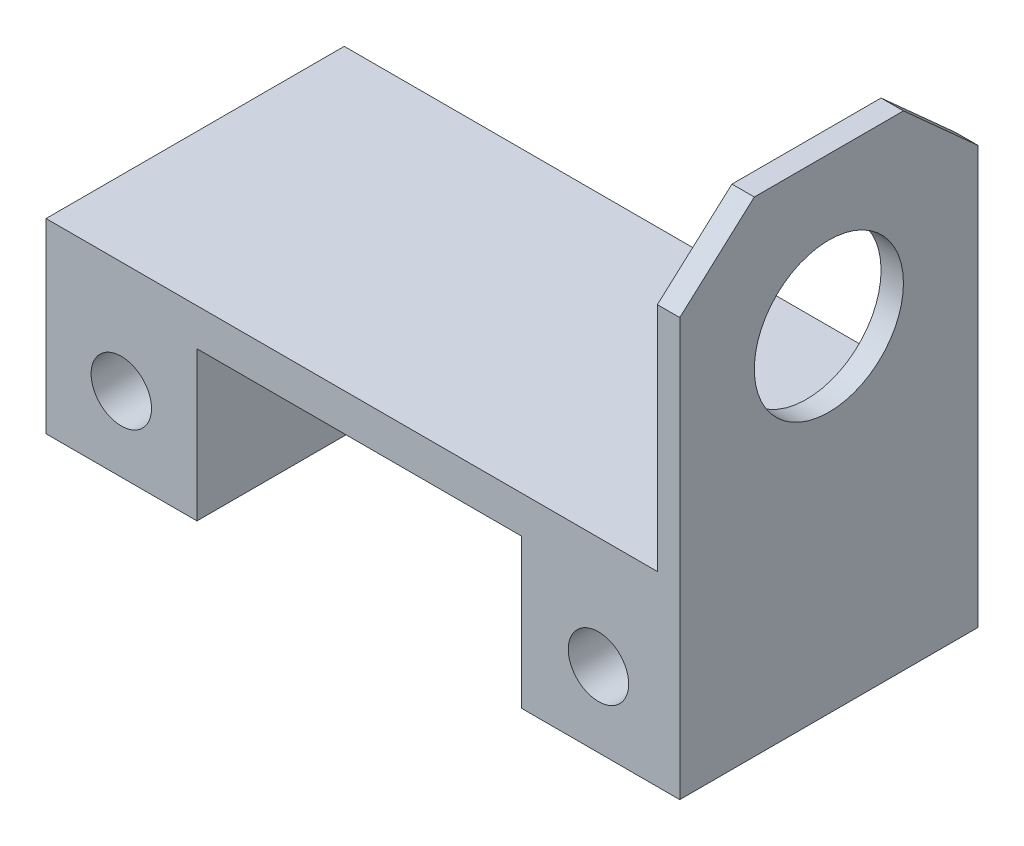
ISO-10303-21;
HEADER;
FILE_DESCRIPTION(('STEP AP214'),'2;1');
FILE_NAME('part.step','',(''),(''),'','','');
FILE_SCHEMA(('AUTOMOTIVE_DESIGN { 1 0 10303 214 1 1 1 1 }'));
ENDSEC;
DATA;
#1=APPLICATION_CONTEXT('core data for automotive mechanical design processes');
#2=APPLICATION_PROTOCOL_DEFINITION('international standard','automotive_design',2000,#1);
#3=PRODUCT_CONTEXT('',#1,'mechanical');
#4=PRODUCT('Part','Part','',(#3));
#5=PRODUCT_RELATED_PRODUCT_CATEGORY('part','',(#4));
#6=PRODUCT_DEFINITION_FORMATION('','',#4);
#7=PRODUCT_DEFINITION_CONTEXT('part definition',#1,'design');
#8=PRODUCT_DEFINITION('design','',#6,#7);
#9=PRODUCT_DEFINITION_SHAPE('','',#8);
#10=(LENGTH_UNIT() NAMED_UNIT(*) SI_UNIT(.MILLI.,.METRE.));
#11=(NAMED_UNIT(*) PLANE_ANGLE_UNIT() SI_UNIT($,.RADIAN.));
#12=(NAMED_UNIT(*) SI_UNIT($,.STERADIAN.) SOLID_ANGLE_UNIT());
#13=UNCERTAINTY_MEASURE_WITH_UNIT(LENGTH_MEASURE(1.E-05),#10,'distance_accuracy_value','');
#14=(GEOMETRIC_REPRESENTATION_CONTEXT(3) GLOBAL_UNCERTAINTY_ASSIGNED_CONTEXT((#13)) GLOBAL_UNIT_ASSIGNED_CONTEXT((#10,
#11,#12)) REPRESENTATION_CONTEXT('',''));
#15=CARTESIAN_POINT('',(0.,0.,0.));
#16=DIRECTION('',(0.,0.,1.));
#17=DIRECTION('',(1.,0.,0.));
#18=AXIS2_PLACEMENT_3D('',#15,#16,#17);
#19=CARTESIAN_POINT('',(0.,12.5,-40.));
#20=DIRECTION('',(0.,-1.,0.));
#21=DIRECTION('',(0.,0.,-1.));
#22=AXIS2_PLACEMENT_3D('',#19,#20,#21);
#23=PLANE('',#22);
#24=DIRECTION('',(0.,0.,1.));
#25=VECTOR('',#24,1.);
#26=CARTESIAN_POINT('',(40.,12.5,-40.));
#27=LINE('',#26,#25);
#28=CARTESIAN_POINT('',(40.,12.5,-40.));
#29=VERTEX_POINT('',#28);
#30=CARTESIAN_POINT('',(40.,12.5,0.));
#31=VERTEX_POINT('',#30);
#32=EDGE_CURVE('E160',#29,#31,#27,.T.);
#33=ORIENTED_EDGE('',*,*,#32,.F.);
#34=DIRECTION('',(1.,0.,0.));
#35=VECTOR('',#34,1.);
#36=CARTESIAN_POINT('',(0.,12.5,-40.));
#37=LINE('',#36,#35);
#38=CARTESIAN_POINT('',(-42.,12.5,-40.));
#39=VERTEX_POINT('',#38);
#40=EDGE_CURVE('E139',#39,#29,#37,.T.);
#41=ORIENTED_EDGE('',*,*,#40,.F.);
#42=DIRECTION('',(0.,0.,1.));
#43=VECTOR('',#42,1.);
#44=CARTESIAN_POINT('',(-42.,12.5,-40.));
#45=LINE('',#44,#43);
#46=CARTESIAN_POINT('',(-42.,12.5,0.));
#47=VERTEX_POINT('',#46);
#48=EDGE_CURVE('E292',#39,#47,#45,.T.);
#49=ORIENTED_EDGE('',*,*,#48,.T.);
#50=DIRECTION('',(1.,0.,0.));
#51=VECTOR('',#50,1.);
#52=CARTESIAN_POINT('',(0.,12.5,0.));
#53=LINE('',#52,#51);
#54=EDGE_CURVE('E290',#47,#31,#53,.T.);
#55=ORIENTED_EDGE('',*,*,#54,.T.);
#56=EDGE_LOOP('',(#33,#41,#49,#55));
#57=FACE_BOUND('',#56,.T.);
#58=ADVANCED_FACE('F47',(#57),#23,.F.);
#59=CARTESIAN_POINT('',(21.75,0.,-40.));
#60=DIRECTION('',(1.,0.,0.));
#61=DIRECTION('',(0.,1.,0.));
#62=AXIS2_PLACEMENT_3D('',#59,#60,#61);
#63=PLANE('',#62);
#64=DIRECTION('',(0.,1.,0.));
#65=VECTOR('',#64,1.);
#66=CARTESIAN_POINT('',(21.75,0.,0.));
#67=LINE('',#66,#65);
#68=CARTESIAN_POINT('',(21.75,-12.5,0.));
#69=VERTEX_POINT('',#68);
#70=CARTESIAN_POINT('',(21.75,7.5,0.));
#71=VERTEX_POINT('',#70);
#72=EDGE_CURVE('E301',#69,#71,#67,.T.);
#73=ORIENTED_EDGE('',*,*,#72,.T.);
#74=DIRECTION('',(0.,0.,1.));
#75=VECTOR('',#74,1.);
#76=CARTESIAN_POINT('',(21.75,7.5,-40.));
#77=LINE('',#76,#75);
#78=CARTESIAN_POINT('',(21.75,7.5,-40.));
#79=VERTEX_POINT('',#78);
#80=EDGE_CURVE('E11',#79,#71,#77,.T.);
#81=ORIENTED_EDGE('',*,*,#80,.F.);
#82=DIRECTION('',(0.,1.,0.));
#83=VECTOR('',#82,1.);
#84=CARTESIAN_POINT('',(21.75,0.,-40.));
#85=LINE('',#84,#83);
#86=CARTESIAN_POINT('',(21.75,-12.5,-40.));
#87=VERTEX_POINT('',#86);
#88=EDGE_CURVE('E67',#87,#79,#85,.T.);
#89=ORIENTED_EDGE('',*,*,#88,.F.);
#90=DIRECTION('',(0.,0.,1.));
#91=VECTOR('',#90,1.);
#92=CARTESIAN_POINT('',(21.75,-12.5,-40.));
#93=LINE('',#92,#91);
#94=EDGE_CURVE('E51',#87,#69,#93,.T.);
#95=ORIENTED_EDGE('',*,*,#94,.T.);
#96=EDGE_LOOP('',(#73,#81,#89,#95));
#97=FACE_BOUND('',#96,.T.);
#98=ADVANCED_FACE('F327',(#97),#63,.F.);
#99=CARTESIAN_POINT('',(0.,7.5,-40.));
#100=DIRECTION('',(0.,-1.,0.));
#101=DIRECTION('',(0.,0.,-1.));
#102=AXIS2_PLACEMENT_3D('',#99,#100,#101);
#103=PLANE('',#102);
#104=DIRECTION('',(1.,0.,0.));
#105=VECTOR('',#104,1.);
#106=CARTESIAN_POINT('',(0.,7.5,0.));
#107=LINE('',#106,#105);
#108=CARTESIAN_POINT('',(-21.75,7.5,0.));
#109=VERTEX_POINT('',#108);
#110=EDGE_CURVE('E159',#109,#71,#107,.T.);
#111=ORIENTED_EDGE('',*,*,#110,.F.);
#112=DIRECTION('',(0.,0.,1.));
#113=VECTOR('',#112,1.);
#114=CARTESIAN_POINT('',(-21.75,7.5,-40.));
#115=LINE('',#114,#113);
#116=CARTESIAN_POINT('',(-21.75,7.5,-40.));
#117=VERTEX_POINT('',#116);
#118=EDGE_CURVE('E58',#117,#109,#115,.T.);
#119=ORIENTED_EDGE('',*,*,#118,.F.);
#120=DIRECTION('',(1.,0.,0.));
#121=VECTOR('',#120,1.);
#122=CARTESIAN_POINT('',(0.,7.5,-40.));
#123=LINE('',#122,#121);
#124=EDGE_CURVE('E130',#117,#79,#123,.T.);
#125=ORIENTED_EDGE('',*,*,#124,.T.);
#126=ORIENTED_EDGE('',*,*,#80,.T.);
#127=EDGE_LOOP('',(#111,#119,#125,#126));
#128=FACE_BOUND('',#127,.T.);
#129=ADVANCED_FACE('F328',(#128),#103,.T.);
#130=CARTESIAN_POINT('',(-21.75,0.,-40.));
#131=DIRECTION('',(1.,0.,0.));
#132=DIRECTION('',(0.,0.,-1.));
#133=AXIS2_PLACEMENT_3D('',#130,#131,#132);
#134=PLANE('',#133);
#135=DIRECTION('',(0.,1.,0.));
#136=VECTOR('',#135,1.);
#137=CARTESIAN_POINT('',(-21.75,0.,0.));
#138=LINE('',#137,#136);
#139=CARTESIAN_POINT('',(-21.75,-12.5,0.));
#140=VERTEX_POINT('',#139);
#141=EDGE_CURVE('E115',#140,#109,#138,.T.);
#142=ORIENTED_EDGE('',*,*,#141,.F.);
#143=DIRECTION('',(0.,0.,1.));
#144=VECTOR('',#143,1.);
#145=CARTESIAN_POINT('',(-21.75,-12.5,-40.));
#146=LINE('',#145,#144);
#147=CARTESIAN_POINT('',(-21.75,-12.5,-40.));
#148=VERTEX_POINT('',#147);
#149=EDGE_CURVE('E111',#148,#140,#146,.T.);
#150=ORIENTED_EDGE('',*,*,#149,.F.);
#151=DIRECTION('',(0.,1.,0.));
#152=VECTOR('',#151,1.);
#153=CARTESIAN_POINT('',(-21.75,0.,-40.));
#154=LINE('',#153,#152);
#155=EDGE_CURVE('E114',#148,#117,#154,.T.);
#156=ORIENTED_EDGE('',*,*,#155,.T.);
#157=ORIENTED_EDGE('',*,*,#118,.T.);
#158=EDGE_LOOP('',(#142,#150,#156,#157));
#159=FACE_BOUND('',#158,.T.);
#160=ADVANCED_FACE('F113',(#159),#134,.T.);
#161=CARTESIAN_POINT('',(0.,-12.5,-40.));
#162=DIRECTION('',(0.,-1.,0.));
#163=DIRECTION('',(0.,0.,-1.));
#164=AXIS2_PLACEMENT_3D('',#161,#162,#163);
#165=PLANE('',#164);
#166=DIRECTION('',(1.,0.,0.));
#167=VECTOR('',#166,1.);
#168=CARTESIAN_POINT('',(0.,-12.5,0.));
#169=LINE('',#168,#167);
#170=CARTESIAN_POINT('',(-42.,-12.5,0.));
#171=VERTEX_POINT('',#170);
#172=EDGE_CURVE('E299',#171,#140,#169,.T.);
#173=ORIENTED_EDGE('',*,*,#172,.F.);
#174=DIRECTION('',(0.,0.,1.));
#175=VECTOR('',#174,1.);
#176=CARTESIAN_POINT('',(-42.,-12.5,-40.));
#177=LINE('',#176,#175);
#178=CARTESIAN_POINT('',(-42.,-12.5,-40.));
#179=VERTEX_POINT('',#178);
#180=EDGE_CURVE('E121',#179,#171,#177,.T.);
#181=ORIENTED_EDGE('',*,*,#180,.F.);
#182=DIRECTION('',(1.,0.,0.));
#183=VECTOR('',#182,1.);
#184=CARTESIAN_POINT('',(0.,-12.5,-40.));
#185=LINE('',#184,#183);
#186=EDGE_CURVE('E128',#179,#148,#185,.T.);
#187=ORIENTED_EDGE('',*,*,#186,.T.);
#188=ORIENTED_EDGE('',*,*,#149,.T.);
#189=EDGE_LOOP('',(#173,#181,#187,#188));
#190=FACE_BOUND('',#189,.T.);
#191=ADVANCED_FACE('F133',(#190),#165,.T.);
#192=CARTESIAN_POINT('',(-42.,0.,-40.));
#193=DIRECTION('',(-1.,0.,0.));
#194=DIRECTION('',(0.,0.,1.));
#195=AXIS2_PLACEMENT_3D('',#192,#193,#194);
#196=PLANE('',#195);
#197=DIRECTION('',(0.,-1.,0.));
#198=VECTOR('',#197,1.);
#199=CARTESIAN_POINT('',(-42.,0.,0.));
#200=LINE('',#199,#198);
#201=EDGE_CURVE('E294',#47,#171,#200,.T.);
#202=ORIENTED_EDGE('',*,*,#201,.F.);
#203=ORIENTED_EDGE('',*,*,#48,.F.);
#204=DIRECTION('',(0.,-1.,0.));
#205=VECTOR('',#204,1.);
#206=CARTESIAN_POINT('',(-42.,0.,-40.));
#207=LINE('',#206,#205);
#208=EDGE_CURVE('E135',#39,#179,#207,.T.);
#209=ORIENTED_EDGE('',*,*,#208,.T.);
#210=ORIENTED_EDGE('',*,*,#180,.T.);
#211=EDGE_LOOP('',(#202,#203,#209,#210));
#212=FACE_BOUND('',#211,.T.);
#213=ADVANCED_FACE('F345',(#212),#196,.T.);
#214=CARTESIAN_POINT('',(-31.9021942818985,-2.5,-40.));
#215=DIRECTION('',(0.,0.,1.));
#216=DIRECTION('',(1.,0.,0.));
#217=AXIS2_PLACEMENT_3D('',#214,#215,#216);
#218=CYLINDRICAL_SURFACE('',#217,4.05);
#219=CARTESIAN_POINT('',(-31.9021942818985,-2.5,-40.));
#220=DIRECTION('',(0.,0.,1.));
#221=DIRECTION('',(1.,0.,0.));
#222=AXIS2_PLACEMENT_3D('',#219,#220,#221);
#223=CIRCLE('',#222,4.05);
#224=CARTESIAN_POINT('',(-27.8521942818985,-2.5,-40.));
#225=VERTEX_POINT('',#224);
#226=EDGE_CURVE('E150',#225,#225,#223,.T.);
#227=ORIENTED_EDGE('',*,*,#226,.F.);
#228=EDGE_LOOP('',(#227));
#229=FACE_BOUND('',#228,.T.);
#230=CARTESIAN_POINT('',(-31.9021942818985,-2.5,0.));
#231=DIRECTION('',(0.,0.,1.));
#232=DIRECTION('',(1.,0.,0.));
#233=AXIS2_PLACEMENT_3D('',#230,#231,#232);
#234=CIRCLE('',#233,4.05);
#235=CARTESIAN_POINT('',(-27.8521942818985,-2.5,0.));
#236=VERTEX_POINT('',#235);
#237=EDGE_CURVE('E323',#236,#236,#234,.T.);
#238=ORIENTED_EDGE('',*,*,#237,.T.);
#239=EDGE_LOOP('',(#238));
#240=FACE_BOUND('',#239,.T.);
#241=ADVANCED_FACE('F347',(#229,#240),#218,.F.);
#242=CARTESIAN_POINT('',(32.0978057181015,-2.5,-40.));
#243=DIRECTION('',(0.,0.,1.));
#244=DIRECTION('',(1.,0.,0.));
#245=AXIS2_PLACEMENT_3D('',#242,#243,#244);
#246=CYLINDRICAL_SURFACE('',#245,4.05);
#247=CARTESIAN_POINT('',(32.0978057181015,-2.5,-40.));
#248=DIRECTION('',(0.,0.,1.));
#249=DIRECTION('',(1.,0.,0.));
#250=AXIS2_PLACEMENT_3D('',#247,#248,#249);
#251=CIRCLE('',#250,4.05);
#252=CARTESIAN_POINT('',(36.1478057181015,-2.5,-40.));
#253=VERTEX_POINT('',#252);
#254=EDGE_CURVE('E153',#253,#253,#251,.T.);
#255=ORIENTED_EDGE('',*,*,#254,.F.);
#256=EDGE_LOOP('',(#255));
#257=FACE_BOUND('',#256,.T.);
#258=CARTESIAN_POINT('',(32.0978057181015,-2.5,0.));
#259=DIRECTION('',(0.,0.,1.));
#260=DIRECTION('',(1.,0.,0.));
#261=AXIS2_PLACEMENT_3D('',#258,#259,#260);
#262=CIRCLE('',#261,4.05);
#263=CARTESIAN_POINT('',(36.1478057181015,-2.5,0.));
#264=VERTEX_POINT('',#263);
#265=EDGE_CURVE('E164',#264,#264,#262,.T.);
#266=ORIENTED_EDGE('',*,*,#265,.T.);
#267=EDGE_LOOP('',(#266));
#268=FACE_BOUND('',#267,.T.);
#269=ADVANCED_FACE('F49',(#257,#268),#246,.F.);
#270=DIRECTION('',(0.,0.,-1.));
#271=VECTOR('',#270,1.);
#272=CARTESIAN_POINT('',(43.,-12.5,0.));
#273=LINE('',#272,#271);
#274=CARTESIAN_POINT('',(43.,-12.5,0.));
#275=VERTEX_POINT('',#274);
#276=CARTESIAN_POINT('',(43.,-12.5,-40.));
#277=VERTEX_POINT('',#276);
#278=EDGE_CURVE('E207',#275,#277,#273,.T.);
#279=ORIENTED_EDGE('',*,*,#278,.F.);
#280=EDGE_CURVE('E295',#69,#275,#169,.T.);
#281=ORIENTED_EDGE('',*,*,#280,.F.);
#282=ORIENTED_EDGE('',*,*,#94,.F.);
#283=EDGE_CURVE('E137',#87,#277,#185,.T.);
#284=ORIENTED_EDGE('',*,*,#283,.T.);
#285=EDGE_LOOP('',(#279,#281,#282,#284));
#286=FACE_BOUND('',#285,.T.);
#287=ADVANCED_FACE('F353',(#286),#165,.T.);
#288=CARTESIAN_POINT('',(0.,0.,-40.));
#289=DIRECTION('',(0.,0.,1.));
#290=DIRECTION('',(1.,0.,0.));
#291=AXIS2_PLACEMENT_3D('',#288,#289,#290);
#292=PLANE('',#291);
#293=DIRECTION('',(0.,1.,0.));
#294=VECTOR('',#293,1.);
#295=CARTESIAN_POINT('',(43.,0.,-40.));
#296=LINE('',#295,#294);
#297=CARTESIAN_POINT('',(43.,43.5,-40.));
#298=VERTEX_POINT('',#297);
#299=EDGE_CURVE('E181',#277,#298,#296,.T.);
#300=ORIENTED_EDGE('',*,*,#299,.F.);
#301=ORIENTED_EDGE('',*,*,#283,.F.);
#302=ORIENTED_EDGE('',*,*,#88,.T.);
#303=ORIENTED_EDGE('',*,*,#124,.F.);
#304=ORIENTED_EDGE('',*,*,#155,.F.);
#305=ORIENTED_EDGE('',*,*,#186,.F.);
#306=ORIENTED_EDGE('',*,*,#208,.F.);
#307=ORIENTED_EDGE('',*,*,#40,.T.);
#308=DIRECTION('',(0.,1.,0.));
#309=VECTOR('',#308,1.);
#310=CARTESIAN_POINT('',(40.,0.,-40.));
#311=LINE('',#310,#309);
#312=CARTESIAN_POINT('',(40.,43.5,-40.));
#313=VERTEX_POINT('',#312);
#314=EDGE_CURVE('E182',#29,#313,#311,.T.);
#315=ORIENTED_EDGE('',*,*,#314,.T.);
#316=DIRECTION('',(-1.,0.,0.));
#317=VECTOR('',#316,1.);
#318=CARTESIAN_POINT('',(43.,43.5,-40.));
#319=LINE('',#318,#317);
#320=EDGE_CURVE('E177',#298,#313,#319,.T.);
#321=ORIENTED_EDGE('',*,*,#320,.F.);
#322=EDGE_LOOP('',(#300,#301,#302,#303,#304,#305,#306,#307,#315,#321));
#323=FACE_BOUND('',#322,.T.);
#324=ORIENTED_EDGE('',*,*,#226,.T.);
#325=EDGE_LOOP('',(#324));
#326=FACE_BOUND('',#325,.T.);
#327=ORIENTED_EDGE('',*,*,#254,.T.);
#328=EDGE_LOOP('',(#327));
#329=FACE_BOUND('',#328,.T.);
#330=ADVANCED_FACE('F125',(#323,#326,#329),#292,.F.);
#331=CARTESIAN_POINT('',(0.,0.,0.));
#332=DIRECTION('',(0.,0.,1.));
#333=DIRECTION('',(1.,0.,0.));
#334=AXIS2_PLACEMENT_3D('',#331,#332,#333);
#335=PLANE('',#334);
#336=DIRECTION('',(0.,1.,0.));
#337=VECTOR('',#336,1.);
#338=CARTESIAN_POINT('',(40.,0.,0.));
#339=LINE('',#338,#337);
#340=CARTESIAN_POINT('',(40.,43.5,0.));
#341=VERTEX_POINT('',#340);
#342=EDGE_CURVE('E187',#31,#341,#339,.T.);
#343=ORIENTED_EDGE('',*,*,#342,.F.);
#344=ORIENTED_EDGE('',*,*,#54,.F.);
#345=ORIENTED_EDGE('',*,*,#201,.T.);
#346=ORIENTED_EDGE('',*,*,#172,.T.);
#347=ORIENTED_EDGE('',*,*,#141,.T.);
#348=ORIENTED_EDGE('',*,*,#110,.T.);
#349=ORIENTED_EDGE('',*,*,#72,.F.);
#350=ORIENTED_EDGE('',*,*,#280,.T.);
#351=DIRECTION('',(0.,1.,0.));
#352=VECTOR('',#351,1.);
#353=CARTESIAN_POINT('',(43.,0.,0.));
#354=LINE('',#353,#352);
#355=CARTESIAN_POINT('',(43.,43.5,0.));
#356=VERTEX_POINT('',#355);
#357=EDGE_CURVE('E210',#275,#356,#354,.T.);
#358=ORIENTED_EDGE('',*,*,#357,.T.);
#359=DIRECTION('',(-1.,0.,0.));
#360=VECTOR('',#359,1.);
#361=CARTESIAN_POINT('',(43.,43.5,0.));
#362=LINE('',#361,#360);
#363=EDGE_CURVE('E173',#356,#341,#362,.T.);
#364=ORIENTED_EDGE('',*,*,#363,.T.);
#365=EDGE_LOOP('',(#343,#344,#345,#346,#347,#348,#349,#350,#358,#364));
#366=FACE_BOUND('',#365,.T.);
#367=ORIENTED_EDGE('',*,*,#265,.F.);
#368=EDGE_LOOP('',(#367));
#369=FACE_BOUND('',#368,.T.);
#370=ORIENTED_EDGE('',*,*,#237,.F.);
#371=EDGE_LOOP('',(#370));
#372=FACE_BOUND('',#371,.T.);
#373=ADVANCED_FACE('F287',(#366,#369,#372),#335,.T.);
#374=CARTESIAN_POINT('',(40.,0.,0.));
#375=DIRECTION('',(1.,0.,0.));
#376=DIRECTION('',(0.,0.,-1.));
#377=AXIS2_PLACEMENT_3D('',#374,#375,#376);
#378=PLANE('',#377);
#379=CARTESIAN_POINT('',(40.,32.5,-20.));
#380=DIRECTION('',(1.,0.,0.));
#381=DIRECTION('',(0.,0.,-1.));
#382=AXIS2_PLACEMENT_3D('',#379,#380,#381);
#383=CIRCLE('',#382,10.);
#384=CARTESIAN_POINT('',(40.,32.5,-30.));
#385=VERTEX_POINT('',#384);
#386=EDGE_CURVE('E203',#385,#385,#383,.T.);
#387=ORIENTED_EDGE('',*,*,#386,.T.);
#388=EDGE_LOOP('',(#387));
#389=FACE_BOUND('',#388,.T.);
#390=ORIENTED_EDGE('',*,*,#314,.F.);
#391=ORIENTED_EDGE('',*,*,#32,.T.);
#392=ORIENTED_EDGE('',*,*,#342,.T.);
#393=DIRECTION('',(0.,-0.66896473162245,0.743294146247166));
#394=VECTOR('',#393,1.);
#395=CARTESIAN_POINT('',(40.,24.0331491712707,21.6298342541436));
#396=LINE('',#395,#394);
#397=CARTESIAN_POINT('',(40.,52.5,-10.));
#398=VERTEX_POINT('',#397);
#399=EDGE_CURVE('E191',#398,#341,#396,.T.);
#400=ORIENTED_EDGE('',*,*,#399,.F.);
#401=DIRECTION('',(0.,0.,-1.));
#402=VECTOR('',#401,1.);
#403=CARTESIAN_POINT('',(40.,52.5,0.));
#404=LINE('',#403,#402);
#405=CARTESIAN_POINT('',(40.,52.5,-30.));
#406=VERTEX_POINT('',#405);
#407=EDGE_CURVE('E195',#398,#406,#404,.T.);
#408=ORIENTED_EDGE('',*,*,#407,.T.);
#409=DIRECTION('',(0.,-0.66896473162245,-0.743294146247166));
#410=VECTOR('',#409,1.);
#411=CARTESIAN_POINT('',(40.,43.9226519337017,-39.5303867403315));
#412=LINE('',#411,#410);
#413=EDGE_CURVE('E199',#406,#313,#412,.T.);
#414=ORIENTED_EDGE('',*,*,#413,.T.);
#415=EDGE_LOOP('',(#390,#391,#392,#400,#408,#414));
#416=FACE_BOUND('',#415,.T.);
#417=ADVANCED_FACE('F281',(#389,#416),#378,.F.);
#418=CARTESIAN_POINT('',(43.,43.9226519337017,-39.5303867403315));
#419=DIRECTION('',(0.,0.743294146247166,-0.668964731622449));
#420=DIRECTION('',(0.,0.66896473162245,0.743294146247166));
#421=AXIS2_PLACEMENT_3D('',#418,#419,#420);
#422=PLANE('',#421);
#423=ORIENTED_EDGE('',*,*,#413,.F.);
#424=DIRECTION('',(-1.,0.,0.));
#425=VECTOR('',#424,1.);
#426=CARTESIAN_POINT('',(43.,52.5,-30.));
#427=LINE('',#426,#425);
#428=CARTESIAN_POINT('',(43.,52.5,-30.));
#429=VERTEX_POINT('',#428);
#430=EDGE_CURVE('E165',#429,#406,#427,.T.);
#431=ORIENTED_EDGE('',*,*,#430,.F.);
#432=DIRECTION('',(0.,-0.66896473162245,-0.743294146247166));
#433=VECTOR('',#432,1.);
#434=CARTESIAN_POINT('',(43.,43.9226519337017,-39.5303867403315));
#435=LINE('',#434,#433);
#436=EDGE_CURVE('E186',#429,#298,#435,.T.);
#437=ORIENTED_EDGE('',*,*,#436,.T.);
#438=ORIENTED_EDGE('',*,*,#320,.T.);
#439=EDGE_LOOP('',(#423,#431,#437,#438));
#440=FACE_BOUND('',#439,.T.);
#441=ADVANCED_FACE('F366',(#440),#422,.T.);
#442=CARTESIAN_POINT('',(43.,52.5,0.));
#443=DIRECTION('',(0.,1.,0.));
#444=DIRECTION('',(0.,0.,1.));
#445=AXIS2_PLACEMENT_3D('',#442,#443,#444);
#446=PLANE('',#445);
#447=ORIENTED_EDGE('',*,*,#407,.F.);
#448=DIRECTION('',(-1.,0.,0.));
#449=VECTOR('',#448,1.);
#450=CARTESIAN_POINT('',(43.,52.5,-10.));
#451=LINE('',#450,#449);
#452=CARTESIAN_POINT('',(43.,52.5,-10.));
#453=VERTEX_POINT('',#452);
#454=EDGE_CURVE('E169',#453,#398,#451,.T.);
#455=ORIENTED_EDGE('',*,*,#454,.F.);
#456=DIRECTION('',(0.,0.,-1.));
#457=VECTOR('',#456,1.);
#458=CARTESIAN_POINT('',(43.,52.5,0.));
#459=LINE('',#458,#457);
#460=EDGE_CURVE('E218',#453,#429,#459,.T.);
#461=ORIENTED_EDGE('',*,*,#460,.T.);
#462=ORIENTED_EDGE('',*,*,#430,.T.);
#463=EDGE_LOOP('',(#447,#455,#461,#462));
#464=FACE_BOUND('',#463,.T.);
#465=ADVANCED_FACE('F254',(#464),#446,.T.);
#466=CARTESIAN_POINT('',(43.,24.0331491712707,21.6298342541436));
#467=DIRECTION('',(0.,-0.743294146247166,-0.66896473162245));
#468=DIRECTION('',(0.,0.66896473162245,-0.743294146247166));
#469=AXIS2_PLACEMENT_3D('',#466,#467,#468);
#470=PLANE('',#469);
#471=ORIENTED_EDGE('',*,*,#399,.T.);
#472=ORIENTED_EDGE('',*,*,#363,.F.);
#473=DIRECTION('',(0.,-0.66896473162245,0.743294146247166));
#474=VECTOR('',#473,1.);
#475=CARTESIAN_POINT('',(43.,24.0331491712707,21.6298342541436));
#476=LINE('',#475,#474);
#477=EDGE_CURVE('E214',#453,#356,#476,.T.);
#478=ORIENTED_EDGE('',*,*,#477,.F.);
#479=ORIENTED_EDGE('',*,*,#454,.T.);
#480=EDGE_LOOP('',(#471,#472,#478,#479));
#481=FACE_BOUND('',#480,.T.);
#482=ADVANCED_FACE('F239',(#481),#470,.F.);
#483=CARTESIAN_POINT('',(43.,0.,0.));
#484=DIRECTION('',(1.,0.,0.));
#485=DIRECTION('',(0.,0.,-1.));
#486=AXIS2_PLACEMENT_3D('',#483,#484,#485);
#487=PLANE('',#486);
#488=CARTESIAN_POINT('',(43.,32.5,-20.));
#489=DIRECTION('',(1.,0.,0.));
#490=DIRECTION('',(0.,0.,-1.));
#491=AXIS2_PLACEMENT_3D('',#488,#489,#490);
#492=CIRCLE('',#491,10.);
#493=CARTESIAN_POINT('',(43.,32.5,-30.));
#494=VERTEX_POINT('',#493);
#495=EDGE_CURVE('E228',#494,#494,#492,.T.);
#496=ORIENTED_EDGE('',*,*,#495,.F.);
#497=EDGE_LOOP('',(#496));
#498=FACE_BOUND('',#497,.T.);
#499=ORIENTED_EDGE('',*,*,#436,.F.);
#500=ORIENTED_EDGE('',*,*,#460,.F.);
#501=ORIENTED_EDGE('',*,*,#477,.T.);
#502=ORIENTED_EDGE('',*,*,#357,.F.);
#503=ORIENTED_EDGE('',*,*,#278,.T.);
#504=ORIENTED_EDGE('',*,*,#299,.T.);
#505=EDGE_LOOP('',(#499,#500,#501,#502,#503,#504));
#506=FACE_BOUND('',#505,.T.);
#507=ADVANCED_FACE('F236',(#498,#506),#487,.T.);
#508=CARTESIAN_POINT('',(-42.,32.5,-20.));
#509=DIRECTION('',(1.,0.,0.));
#510=DIRECTION('',(0.,0.,-1.));
#511=AXIS2_PLACEMENT_3D('',#508,#509,#510);
#512=CYLINDRICAL_SURFACE('',#511,10.);
#513=ORIENTED_EDGE('',*,*,#495,.T.);
#514=EDGE_LOOP('',(#513));
#515=FACE_BOUND('',#514,.T.);
#516=ORIENTED_EDGE('',*,*,#386,.F.);
#517=EDGE_LOOP('',(#516));
#518=FACE_BOUND('',#517,.T.);
#519=ADVANCED_FACE('F233',(#515,#518),#512,.F.);
#520=CLOSED_SHELL('',(#58,#98,#129,#160,#191,#213,#241,#269,#287,#330,#373,#417,#441,#465,#482,
#507,#519));
#521=MANIFOLD_SOLID_BREP('B2',#520);
#522=ADVANCED_BREP_SHAPE_REPRESENTATION('',(#18,#521),#14);
#523=SHAPE_DEFINITION_REPRESENTATION(#9,#522);
ENDSEC;
END-ISO-10303-21;
